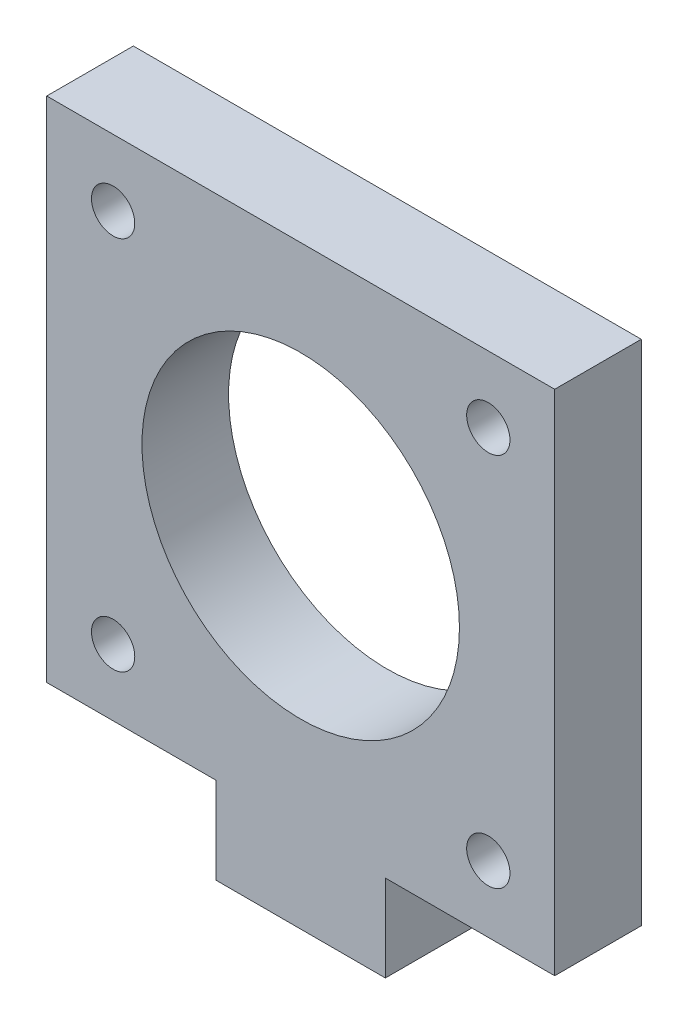
ISO-10303-21;
HEADER;
FILE_DESCRIPTION(('STEP AP214'),'2;1');
FILE_NAME('part.step','',(''),(''),'','','');
FILE_SCHEMA(('AUTOMOTIVE_DESIGN { 1 0 10303 214 1 1 1 1 }'));
ENDSEC;
DATA;
#1=APPLICATION_CONTEXT('core data for automotive mechanical design processes');
#2=APPLICATION_PROTOCOL_DEFINITION('international standard','automotive_design',2000,#1);
#3=PRODUCT_CONTEXT('',#1,'mechanical');
#4=PRODUCT('Part','Part','',(#3));
#5=PRODUCT_RELATED_PRODUCT_CATEGORY('part','',(#4));
#6=PRODUCT_DEFINITION_FORMATION('','',#4);
#7=PRODUCT_DEFINITION_CONTEXT('part definition',#1,'design');
#8=PRODUCT_DEFINITION('design','',#6,#7);
#9=PRODUCT_DEFINITION_SHAPE('','',#8);
#10=(LENGTH_UNIT() NAMED_UNIT(*) SI_UNIT(.MILLI.,.METRE.));
#11=(NAMED_UNIT(*) PLANE_ANGLE_UNIT() SI_UNIT($,.RADIAN.));
#12=(NAMED_UNIT(*) SI_UNIT($,.STERADIAN.) SOLID_ANGLE_UNIT());
#13=UNCERTAINTY_MEASURE_WITH_UNIT(LENGTH_MEASURE(1.E-05),#10,'distance_accuracy_value','');
#14=(GEOMETRIC_REPRESENTATION_CONTEXT(3) GLOBAL_UNCERTAINTY_ASSIGNED_CONTEXT((#13)) GLOBAL_UNIT_ASSIGNED_CONTEXT((#10,
#11,#12)) REPRESENTATION_CONTEXT('',''));
#15=CARTESIAN_POINT('',(0.,0.,0.));
#16=DIRECTION('',(0.,0.,1.));
#17=DIRECTION('',(1.,0.,0.));
#18=AXIS2_PLACEMENT_3D('',#15,#16,#17);
#19=CARTESIAN_POINT('',(0.,0.,6.));
#20=DIRECTION('',(0.,0.,1.));
#21=DIRECTION('',(1.,0.,0.));
#22=AXIS2_PLACEMENT_3D('',#19,#20,#21);
#23=PLANE('',#22);
#24=CARTESIAN_POINT('',(312.316937195697,230.398518153976,6.));
#25=DIRECTION('',(0.,0.,1.));
#26=DIRECTION('',(1.,0.,0.));
#27=AXIS2_PLACEMENT_3D('',#24,#25,#26);
#28=CIRCLE('',#27,1.4996335969685);
#29=CARTESIAN_POINT('',(313.816570792665,230.398518153976,6.));
#30=VERTEX_POINT('',#29);
#31=EDGE_CURVE('E193',#30,#30,#28,.T.);
#32=ORIENTED_EDGE('',*,*,#31,.F.);
#33=EDGE_LOOP('',(#32));
#34=FACE_BOUND('',#33,.T.);
#35=CARTESIAN_POINT('',(338.316937195697,256.398518153975,6.));
#36=DIRECTION('',(0.,0.,1.));
#37=DIRECTION('',(1.,0.,0.));
#38=AXIS2_PLACEMENT_3D('',#35,#36,#37);
#39=CIRCLE('',#38,1.50000000000002);
#40=CARTESIAN_POINT('',(339.816937195697,256.398518153975,6.));
#41=VERTEX_POINT('',#40);
#42=EDGE_CURVE('E181',#41,#41,#39,.T.);
#43=ORIENTED_EDGE('',*,*,#42,.F.);
#44=EDGE_LOOP('',(#43));
#45=FACE_BOUND('',#44,.T.);
#46=DIRECTION('',(1.,0.,0.));
#47=VECTOR('',#46,1.);
#48=CARTESIAN_POINT('',(331.183603862363,225.798518153976,6.));
#49=LINE('',#48,#47);
#50=CARTESIAN_POINT('',(331.183603862363,225.798518153976,6.));
#51=VERTEX_POINT('',#50);
#52=CARTESIAN_POINT('',(342.916937195697,225.798518153976,6.));
#53=VERTEX_POINT('',#52);
#54=EDGE_CURVE('E144',#51,#53,#49,.T.);
#55=ORIENTED_EDGE('',*,*,#54,.T.);
#56=DIRECTION('',(0.,1.,0.));
#57=VECTOR('',#56,1.);
#58=CARTESIAN_POINT('',(342.916937195697,225.798518153976,6.));
#59=LINE('',#58,#57);
#60=CARTESIAN_POINT('',(342.916937195697,260.998518153976,6.));
#61=VERTEX_POINT('',#60);
#62=EDGE_CURVE('E92',#53,#61,#59,.T.);
#63=ORIENTED_EDGE('',*,*,#62,.T.);
#64=DIRECTION('',(-1.,0.,0.));
#65=VECTOR('',#64,1.);
#66=CARTESIAN_POINT('',(342.916937195697,260.998518153976,6.));
#67=LINE('',#66,#65);
#68=CARTESIAN_POINT('',(307.716937195697,260.998518153976,6.));
#69=VERTEX_POINT('',#68);
#70=EDGE_CURVE('E159',#61,#69,#67,.T.);
#71=ORIENTED_EDGE('',*,*,#70,.T.);
#72=DIRECTION('',(0.,-1.,0.));
#73=VECTOR('',#72,1.);
#74=CARTESIAN_POINT('',(307.716937195697,260.998518153976,6.));
#75=LINE('',#74,#73);
#76=CARTESIAN_POINT('',(307.716937195697,225.798518153976,6.));
#77=VERTEX_POINT('',#76);
#78=EDGE_CURVE('E172',#69,#77,#75,.T.);
#79=ORIENTED_EDGE('',*,*,#78,.T.);
#80=DIRECTION('',(1.,0.,0.));
#81=VECTOR('',#80,1.);
#82=CARTESIAN_POINT('',(307.716937195697,225.798518153976,6.));
#83=LINE('',#82,#81);
#84=CARTESIAN_POINT('',(319.45027052903,225.798518153976,6.));
#85=VERTEX_POINT('',#84);
#86=EDGE_CURVE('E111',#77,#85,#83,.T.);
#87=ORIENTED_EDGE('',*,*,#86,.T.);
#88=DIRECTION('',(0.,-1.,0.));
#89=VECTOR('',#88,1.);
#90=CARTESIAN_POINT('',(319.45027052903,225.798518153976,6.));
#91=LINE('',#90,#89);
#92=CARTESIAN_POINT('',(319.45027052903,219.798518153976,6.));
#93=VERTEX_POINT('',#92);
#94=EDGE_CURVE('E105',#85,#93,#91,.T.);
#95=ORIENTED_EDGE('',*,*,#94,.T.);
#96=DIRECTION('',(1.,0.,0.));
#97=VECTOR('',#96,1.);
#98=CARTESIAN_POINT('',(319.45027052903,219.798518153976,6.));
#99=LINE('',#98,#97);
#100=CARTESIAN_POINT('',(331.183603862363,219.798518153976,6.));
#101=VERTEX_POINT('',#100);
#102=EDGE_CURVE('E109',#93,#101,#99,.T.);
#103=ORIENTED_EDGE('',*,*,#102,.T.);
#104=DIRECTION('',(0.,1.,0.));
#105=VECTOR('',#104,1.);
#106=CARTESIAN_POINT('',(331.183603862363,219.798518153976,6.));
#107=LINE('',#106,#105);
#108=EDGE_CURVE('E49',#101,#51,#107,.T.);
#109=ORIENTED_EDGE('',*,*,#108,.T.);
#110=EDGE_LOOP('',(#55,#63,#71,#79,#87,#95,#103,#109));
#111=FACE_BOUND('',#110,.T.);
#112=CARTESIAN_POINT('',(338.316937195697,230.398518153975,6.));
#113=DIRECTION('',(0.,0.,1.));
#114=DIRECTION('',(1.,0.,0.));
#115=AXIS2_PLACEMENT_3D('',#112,#113,#114);
#116=CIRCLE('',#115,1.50000000000002);
#117=CARTESIAN_POINT('',(339.816937195697,230.398518153975,6.));
#118=VERTEX_POINT('',#117);
#119=EDGE_CURVE('E133',#118,#118,#116,.T.);
#120=ORIENTED_EDGE('',*,*,#119,.F.);
#121=EDGE_LOOP('',(#120));
#122=FACE_BOUND('',#121,.T.);
#123=CARTESIAN_POINT('',(312.316937195697,256.398518153976,6.));
#124=DIRECTION('',(0.,0.,1.));
#125=DIRECTION('',(1.,0.,0.));
#126=AXIS2_PLACEMENT_3D('',#123,#124,#125);
#127=CIRCLE('',#126,1.50000000000002);
#128=CARTESIAN_POINT('',(313.816937195697,256.398518153976,6.));
#129=VERTEX_POINT('',#128);
#130=EDGE_CURVE('E187',#129,#129,#127,.T.);
#131=ORIENTED_EDGE('',*,*,#130,.F.);
#132=EDGE_LOOP('',(#131));
#133=FACE_BOUND('',#132,.T.);
#134=CARTESIAN_POINT('',(325.316937195697,243.398518153976,6.));
#135=DIRECTION('',(0.,0.,1.));
#136=DIRECTION('',(1.,0.,0.));
#137=AXIS2_PLACEMENT_3D('',#134,#135,#136);
#138=CIRCLE('',#137,11.);
#139=CARTESIAN_POINT('',(336.316937195697,243.398518153976,6.));
#140=VERTEX_POINT('',#139);
#141=EDGE_CURVE('E199',#140,#140,#138,.T.);
#142=ORIENTED_EDGE('',*,*,#141,.F.);
#143=EDGE_LOOP('',(#142));
#144=FACE_BOUND('',#143,.T.);
#145=ADVANCED_FACE('F32',(#34,#45,#111,#122,#133,#144),#23,.T.);
#146=CARTESIAN_POINT('',(0.,0.,0.));
#147=DIRECTION('',(0.,0.,1.));
#148=DIRECTION('',(1.,0.,0.));
#149=AXIS2_PLACEMENT_3D('',#146,#147,#148);
#150=PLANE('',#149);
#151=DIRECTION('',(1.,0.,0.));
#152=VECTOR('',#151,1.);
#153=CARTESIAN_POINT('',(331.183603862363,225.798518153976,0.));
#154=LINE('',#153,#152);
#155=CARTESIAN_POINT('',(331.183603862363,225.798518153976,0.));
#156=VERTEX_POINT('',#155);
#157=CARTESIAN_POINT('',(342.916937195697,225.798518153976,0.));
#158=VERTEX_POINT('',#157);
#159=EDGE_CURVE('E129',#156,#158,#154,.T.);
#160=ORIENTED_EDGE('',*,*,#159,.F.);
#161=DIRECTION('',(0.,1.,0.));
#162=VECTOR('',#161,1.);
#163=CARTESIAN_POINT('',(331.183603862363,219.798518153976,0.));
#164=LINE('',#163,#162);
#165=CARTESIAN_POINT('',(331.183603862363,219.798518153976,0.));
#166=VERTEX_POINT('',#165);
#167=EDGE_CURVE('E84',#166,#156,#164,.T.);
#168=ORIENTED_EDGE('',*,*,#167,.F.);
#169=DIRECTION('',(1.,0.,0.));
#170=VECTOR('',#169,1.);
#171=CARTESIAN_POINT('',(319.45027052903,219.798518153976,0.));
#172=LINE('',#171,#170);
#173=CARTESIAN_POINT('',(319.45027052903,219.798518153976,0.));
#174=VERTEX_POINT('',#173);
#175=EDGE_CURVE('E78',#174,#166,#172,.T.);
#176=ORIENTED_EDGE('',*,*,#175,.F.);
#177=DIRECTION('',(0.,-1.,0.));
#178=VECTOR('',#177,1.);
#179=CARTESIAN_POINT('',(319.45027052903,225.798518153976,0.));
#180=LINE('',#179,#178);
#181=CARTESIAN_POINT('',(319.45027052903,225.798518153976,0.));
#182=VERTEX_POINT('',#181);
#183=EDGE_CURVE('E119',#182,#174,#180,.T.);
#184=ORIENTED_EDGE('',*,*,#183,.F.);
#185=DIRECTION('',(1.,0.,0.));
#186=VECTOR('',#185,1.);
#187=CARTESIAN_POINT('',(307.716937195697,225.798518153976,0.));
#188=LINE('',#187,#186);
#189=CARTESIAN_POINT('',(307.716937195697,225.798518153976,0.));
#190=VERTEX_POINT('',#189);
#191=EDGE_CURVE('E139',#190,#182,#188,.T.);
#192=ORIENTED_EDGE('',*,*,#191,.F.);
#193=DIRECTION('',(0.,-1.,0.));
#194=VECTOR('',#193,1.);
#195=CARTESIAN_POINT('',(307.716937195697,260.998518153976,0.));
#196=LINE('',#195,#194);
#197=CARTESIAN_POINT('',(307.716937195697,260.998518153976,0.));
#198=VERTEX_POINT('',#197);
#199=EDGE_CURVE('E137',#198,#190,#196,.T.);
#200=ORIENTED_EDGE('',*,*,#199,.F.);
#201=DIRECTION('',(-1.,0.,0.));
#202=VECTOR('',#201,1.);
#203=CARTESIAN_POINT('',(342.916937195697,260.998518153976,0.));
#204=LINE('',#203,#202);
#205=CARTESIAN_POINT('',(342.916937195697,260.998518153976,0.));
#206=VERTEX_POINT('',#205);
#207=EDGE_CURVE('E135',#206,#198,#204,.T.);
#208=ORIENTED_EDGE('',*,*,#207,.F.);
#209=DIRECTION('',(0.,1.,0.));
#210=VECTOR('',#209,1.);
#211=CARTESIAN_POINT('',(342.916937195697,225.798518153976,0.));
#212=LINE('',#211,#210);
#213=EDGE_CURVE('E132',#158,#206,#212,.T.);
#214=ORIENTED_EDGE('',*,*,#213,.F.);
#215=EDGE_LOOP('',(#160,#168,#176,#184,#192,#200,#208,#214));
#216=FACE_BOUND('',#215,.T.);
#217=CARTESIAN_POINT('',(338.316937195697,230.398518153975,0.));
#218=DIRECTION('',(0.,0.,1.));
#219=DIRECTION('',(1.,0.,0.));
#220=AXIS2_PLACEMENT_3D('',#217,#218,#219);
#221=CIRCLE('',#220,1.50000000000002);
#222=CARTESIAN_POINT('',(339.816937195697,230.398518153975,0.));
#223=VERTEX_POINT('',#222);
#224=EDGE_CURVE('E178',#223,#223,#221,.T.);
#225=ORIENTED_EDGE('',*,*,#224,.T.);
#226=EDGE_LOOP('',(#225));
#227=FACE_BOUND('',#226,.T.);
#228=CARTESIAN_POINT('',(338.316937195697,256.398518153975,0.));
#229=DIRECTION('',(0.,0.,1.));
#230=DIRECTION('',(1.,0.,0.));
#231=AXIS2_PLACEMENT_3D('',#228,#229,#230);
#232=CIRCLE('',#231,1.50000000000002);
#233=CARTESIAN_POINT('',(339.816937195697,256.398518153975,0.));
#234=VERTEX_POINT('',#233);
#235=EDGE_CURVE('E184',#234,#234,#232,.T.);
#236=ORIENTED_EDGE('',*,*,#235,.T.);
#237=EDGE_LOOP('',(#236));
#238=FACE_BOUND('',#237,.T.);
#239=CARTESIAN_POINT('',(312.316937195697,256.398518153976,0.));
#240=DIRECTION('',(0.,0.,1.));
#241=DIRECTION('',(1.,0.,0.));
#242=AXIS2_PLACEMENT_3D('',#239,#240,#241);
#243=CIRCLE('',#242,1.50000000000002);
#244=CARTESIAN_POINT('',(313.816937195697,256.398518153976,0.));
#245=VERTEX_POINT('',#244);
#246=EDGE_CURVE('E190',#245,#245,#243,.T.);
#247=ORIENTED_EDGE('',*,*,#246,.T.);
#248=EDGE_LOOP('',(#247));
#249=FACE_BOUND('',#248,.T.);
#250=CARTESIAN_POINT('',(312.316937195697,230.398518153976,0.));
#251=DIRECTION('',(0.,0.,1.));
#252=DIRECTION('',(1.,0.,0.));
#253=AXIS2_PLACEMENT_3D('',#250,#251,#252);
#254=CIRCLE('',#253,1.4996335969685);
#255=CARTESIAN_POINT('',(313.816570792665,230.398518153976,0.));
#256=VERTEX_POINT('',#255);
#257=EDGE_CURVE('E196',#256,#256,#254,.T.);
#258=ORIENTED_EDGE('',*,*,#257,.T.);
#259=EDGE_LOOP('',(#258));
#260=FACE_BOUND('',#259,.T.);
#261=CARTESIAN_POINT('',(325.316937195697,243.398518153976,0.));
#262=DIRECTION('',(0.,0.,1.));
#263=DIRECTION('',(1.,0.,0.));
#264=AXIS2_PLACEMENT_3D('',#261,#262,#263);
#265=CIRCLE('',#264,11.);
#266=CARTESIAN_POINT('',(336.316937195697,243.398518153976,0.));
#267=VERTEX_POINT('',#266);
#268=EDGE_CURVE('E202',#267,#267,#265,.T.);
#269=ORIENTED_EDGE('',*,*,#268,.T.);
#270=EDGE_LOOP('',(#269));
#271=FACE_BOUND('',#270,.T.);
#272=ADVANCED_FACE('F163',(#216,#227,#238,#249,#260,#271),#150,.F.);
#273=CARTESIAN_POINT('',(331.183603862363,225.798518153976,6.));
#274=DIRECTION('',(0.,1.,0.));
#275=DIRECTION('',(0.,0.,1.));
#276=AXIS2_PLACEMENT_3D('',#273,#274,#275);
#277=PLANE('',#276);
#278=ORIENTED_EDGE('',*,*,#159,.T.);
#279=DIRECTION('',(0.,0.,-1.));
#280=VECTOR('',#279,1.);
#281=CARTESIAN_POINT('',(342.916937195697,225.798518153976,6.));
#282=LINE('',#281,#280);
#283=EDGE_CURVE('E11',#53,#158,#282,.T.);
#284=ORIENTED_EDGE('',*,*,#283,.F.);
#285=ORIENTED_EDGE('',*,*,#54,.F.);
#286=DIRECTION('',(0.,0.,-1.));
#287=VECTOR('',#286,1.);
#288=CARTESIAN_POINT('',(331.183603862363,225.798518153976,6.));
#289=LINE('',#288,#287);
#290=EDGE_CURVE('E125',#51,#156,#289,.T.);
#291=ORIENTED_EDGE('',*,*,#290,.T.);
#292=EDGE_LOOP('',(#278,#284,#285,#291));
#293=FACE_BOUND('',#292,.T.);
#294=ADVANCED_FACE('F34',(#293),#277,.F.);
#295=CARTESIAN_POINT('',(342.916937195697,225.798518153976,6.));
#296=DIRECTION('',(-1.,0.,0.));
#297=DIRECTION('',(0.,0.,1.));
#298=AXIS2_PLACEMENT_3D('',#295,#296,#297);
#299=PLANE('',#298);
#300=ORIENTED_EDGE('',*,*,#213,.T.);
#301=DIRECTION('',(0.,0.,-1.));
#302=VECTOR('',#301,1.);
#303=CARTESIAN_POINT('',(342.916937195697,260.998518153976,6.));
#304=LINE('',#303,#302);
#305=EDGE_CURVE('E41',#61,#206,#304,.T.);
#306=ORIENTED_EDGE('',*,*,#305,.F.);
#307=ORIENTED_EDGE('',*,*,#62,.F.);
#308=ORIENTED_EDGE('',*,*,#283,.T.);
#309=EDGE_LOOP('',(#300,#306,#307,#308));
#310=FACE_BOUND('',#309,.T.);
#311=ADVANCED_FACE('F236',(#310),#299,.F.);
#312=CARTESIAN_POINT('',(342.916937195697,260.998518153976,6.));
#313=DIRECTION('',(0.,-1.,0.));
#314=DIRECTION('',(0.,0.,-1.));
#315=AXIS2_PLACEMENT_3D('',#312,#313,#314);
#316=PLANE('',#315);
#317=ORIENTED_EDGE('',*,*,#207,.T.);
#318=DIRECTION('',(0.,0.,-1.));
#319=VECTOR('',#318,1.);
#320=CARTESIAN_POINT('',(307.716937195697,260.998518153976,6.));
#321=LINE('',#320,#319);
#322=EDGE_CURVE('E151',#69,#198,#321,.T.);
#323=ORIENTED_EDGE('',*,*,#322,.F.);
#324=ORIENTED_EDGE('',*,*,#70,.F.);
#325=ORIENTED_EDGE('',*,*,#305,.T.);
#326=EDGE_LOOP('',(#317,#323,#324,#325));
#327=FACE_BOUND('',#326,.T.);
#328=ADVANCED_FACE('F157',(#327),#316,.F.);
#329=CARTESIAN_POINT('',(307.716937195697,260.998518153976,6.));
#330=DIRECTION('',(1.,0.,0.));
#331=DIRECTION('',(0.,0.,-1.));
#332=AXIS2_PLACEMENT_3D('',#329,#330,#331);
#333=PLANE('',#332);
#334=ORIENTED_EDGE('',*,*,#199,.T.);
#335=DIRECTION('',(0.,0.,-1.));
#336=VECTOR('',#335,1.);
#337=CARTESIAN_POINT('',(307.716937195697,225.798518153976,6.));
#338=LINE('',#337,#336);
#339=EDGE_CURVE('E148',#77,#190,#338,.T.);
#340=ORIENTED_EDGE('',*,*,#339,.F.);
#341=ORIENTED_EDGE('',*,*,#78,.F.);
#342=ORIENTED_EDGE('',*,*,#322,.T.);
#343=EDGE_LOOP('',(#334,#340,#341,#342));
#344=FACE_BOUND('',#343,.T.);
#345=ADVANCED_FACE('F168',(#344),#333,.F.);
#346=CARTESIAN_POINT('',(307.716937195697,225.798518153976,6.));
#347=DIRECTION('',(0.,1.,0.));
#348=DIRECTION('',(0.,0.,1.));
#349=AXIS2_PLACEMENT_3D('',#346,#347,#348);
#350=PLANE('',#349);
#351=ORIENTED_EDGE('',*,*,#191,.T.);
#352=DIRECTION('',(0.,0.,-1.));
#353=VECTOR('',#352,1.);
#354=CARTESIAN_POINT('',(319.45027052903,225.798518153976,6.));
#355=LINE('',#354,#353);
#356=EDGE_CURVE('E120',#85,#182,#355,.T.);
#357=ORIENTED_EDGE('',*,*,#356,.F.);
#358=ORIENTED_EDGE('',*,*,#86,.F.);
#359=ORIENTED_EDGE('',*,*,#339,.T.);
#360=EDGE_LOOP('',(#351,#357,#358,#359));
#361=FACE_BOUND('',#360,.T.);
#362=ADVANCED_FACE('F171',(#361),#350,.F.);
#363=CARTESIAN_POINT('',(319.45027052903,225.798518153976,6.));
#364=DIRECTION('',(1.,0.,0.));
#365=DIRECTION('',(0.,1.,0.));
#366=AXIS2_PLACEMENT_3D('',#363,#364,#365);
#367=PLANE('',#366);
#368=ORIENTED_EDGE('',*,*,#183,.T.);
#369=DIRECTION('',(0.,0.,-1.));
#370=VECTOR('',#369,1.);
#371=CARTESIAN_POINT('',(319.45027052903,219.798518153976,6.));
#372=LINE('',#371,#370);
#373=EDGE_CURVE('E116',#93,#174,#372,.T.);
#374=ORIENTED_EDGE('',*,*,#373,.F.);
#375=ORIENTED_EDGE('',*,*,#94,.F.);
#376=ORIENTED_EDGE('',*,*,#356,.T.);
#377=EDGE_LOOP('',(#368,#374,#375,#376));
#378=FACE_BOUND('',#377,.T.);
#379=ADVANCED_FACE('F117',(#378),#367,.F.);
#380=CARTESIAN_POINT('',(319.45027052903,219.798518153976,6.));
#381=DIRECTION('',(0.,1.,0.));
#382=DIRECTION('',(0.,0.,1.));
#383=AXIS2_PLACEMENT_3D('',#380,#381,#382);
#384=PLANE('',#383);
#385=ORIENTED_EDGE('',*,*,#175,.T.);
#386=DIRECTION('',(0.,0.,-1.));
#387=VECTOR('',#386,1.);
#388=CARTESIAN_POINT('',(331.183603862363,219.798518153976,6.));
#389=LINE('',#388,#387);
#390=EDGE_CURVE('E121',#101,#166,#389,.T.);
#391=ORIENTED_EDGE('',*,*,#390,.F.);
#392=ORIENTED_EDGE('',*,*,#102,.F.);
#393=ORIENTED_EDGE('',*,*,#373,.T.);
#394=EDGE_LOOP('',(#385,#391,#392,#393));
#395=FACE_BOUND('',#394,.T.);
#396=ADVANCED_FACE('F123',(#395),#384,.F.);
#397=CARTESIAN_POINT('',(331.183603862363,219.798518153976,6.));
#398=DIRECTION('',(-1.,0.,0.));
#399=DIRECTION('',(0.,0.,1.));
#400=AXIS2_PLACEMENT_3D('',#397,#398,#399);
#401=PLANE('',#400);
#402=ORIENTED_EDGE('',*,*,#167,.T.);
#403=ORIENTED_EDGE('',*,*,#290,.F.);
#404=ORIENTED_EDGE('',*,*,#108,.F.);
#405=ORIENTED_EDGE('',*,*,#390,.T.);
#406=EDGE_LOOP('',(#402,#403,#404,#405));
#407=FACE_BOUND('',#406,.T.);
#408=ADVANCED_FACE('F224',(#407),#401,.F.);
#409=CARTESIAN_POINT('',(338.316937195697,230.398518153975,6.));
#410=DIRECTION('',(0.,0.,-1.));
#411=DIRECTION('',(-1.,0.,0.));
#412=AXIS2_PLACEMENT_3D('',#409,#410,#411);
#413=CYLINDRICAL_SURFACE('',#412,1.50000000000002);
#414=ORIENTED_EDGE('',*,*,#119,.T.);
#415=EDGE_LOOP('',(#414));
#416=FACE_BOUND('',#415,.T.);
#417=ORIENTED_EDGE('',*,*,#224,.F.);
#418=EDGE_LOOP('',(#417));
#419=FACE_BOUND('',#418,.T.);
#420=ADVANCED_FACE('F221',(#416,#419),#413,.F.);
#421=CARTESIAN_POINT('',(338.316937195697,256.398518153975,6.));
#422=DIRECTION('',(0.,0.,-1.));
#423=DIRECTION('',(-1.,0.,0.));
#424=AXIS2_PLACEMENT_3D('',#421,#422,#423);
#425=CYLINDRICAL_SURFACE('',#424,1.50000000000002);
#426=ORIENTED_EDGE('',*,*,#42,.T.);
#427=EDGE_LOOP('',(#426));
#428=FACE_BOUND('',#427,.T.);
#429=ORIENTED_EDGE('',*,*,#235,.F.);
#430=EDGE_LOOP('',(#429));
#431=FACE_BOUND('',#430,.T.);
#432=ADVANCED_FACE('F300',(#428,#431),#425,.F.);
#433=CARTESIAN_POINT('',(312.316937195697,256.398518153976,6.));
#434=DIRECTION('',(0.,0.,-1.));
#435=DIRECTION('',(-1.,0.,0.));
#436=AXIS2_PLACEMENT_3D('',#433,#434,#435);
#437=CYLINDRICAL_SURFACE('',#436,1.50000000000002);
#438=ORIENTED_EDGE('',*,*,#130,.T.);
#439=EDGE_LOOP('',(#438));
#440=FACE_BOUND('',#439,.T.);
#441=ORIENTED_EDGE('',*,*,#246,.F.);
#442=EDGE_LOOP('',(#441));
#443=FACE_BOUND('',#442,.T.);
#444=ADVANCED_FACE('F308',(#440,#443),#437,.F.);
#445=CARTESIAN_POINT('',(312.316937195697,230.398518153976,6.));
#446=DIRECTION('',(0.,0.,-1.));
#447=DIRECTION('',(-1.,0.,0.));
#448=AXIS2_PLACEMENT_3D('',#445,#446,#447);
#449=CYLINDRICAL_SURFACE('',#448,1.4996335969685);
#450=ORIENTED_EDGE('',*,*,#31,.T.);
#451=EDGE_LOOP('',(#450));
#452=FACE_BOUND('',#451,.T.);
#453=ORIENTED_EDGE('',*,*,#257,.F.);
#454=EDGE_LOOP('',(#453));
#455=FACE_BOUND('',#454,.T.);
#456=ADVANCED_FACE('F316',(#452,#455),#449,.F.);
#457=CARTESIAN_POINT('',(325.316937195697,243.398518153976,6.));
#458=DIRECTION('',(0.,0.,-1.));
#459=DIRECTION('',(-1.,0.,0.));
#460=AXIS2_PLACEMENT_3D('',#457,#458,#459);
#461=CYLINDRICAL_SURFACE('',#460,11.);
#462=ORIENTED_EDGE('',*,*,#141,.T.);
#463=EDGE_LOOP('',(#462));
#464=FACE_BOUND('',#463,.T.);
#465=ORIENTED_EDGE('',*,*,#268,.F.);
#466=EDGE_LOOP('',(#465));
#467=FACE_BOUND('',#466,.T.);
#468=ADVANCED_FACE('F208',(#464,#467),#461,.F.);
#469=CLOSED_SHELL('',(#145,#272,#294,#311,#328,#345,#362,#379,#396,#408,#420,#432,#444,#456,#468));
#470=MANIFOLD_SOLID_BREP('B2',#469);
#471=ADVANCED_BREP_SHAPE_REPRESENTATION('',(#18,#470),#14);
#472=SHAPE_DEFINITION_REPRESENTATION(#9,#471);
ENDSEC;
END-ISO-10303-21;
